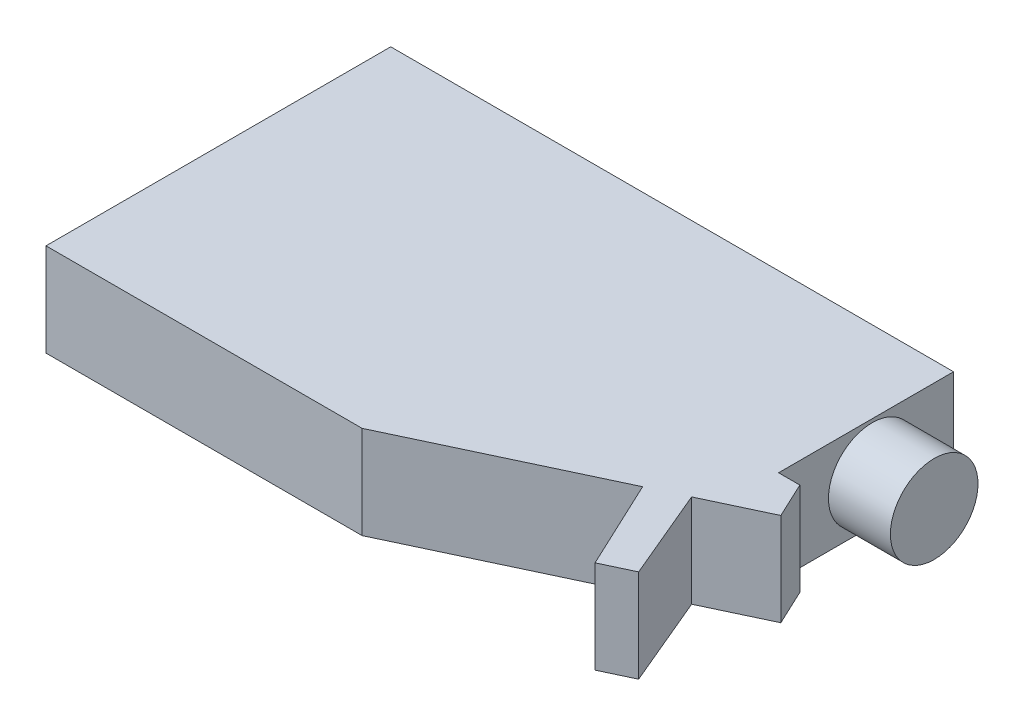
ISO-10303-21;
HEADER;
FILE_DESCRIPTION(('STEP AP214'),'2;1');
FILE_NAME('part.step','',(''),(''),'','','');
FILE_SCHEMA(('AUTOMOTIVE_DESIGN { 1 0 10303 214 1 1 1 1 }'));
ENDSEC;
DATA;
#1=APPLICATION_CONTEXT('core data for automotive mechanical design processes');
#2=APPLICATION_PROTOCOL_DEFINITION('international standard','automotive_design',2000,#1);
#3=PRODUCT_CONTEXT('',#1,'mechanical');
#4=PRODUCT('Part','Part','',(#3));
#5=PRODUCT_RELATED_PRODUCT_CATEGORY('part','',(#4));
#6=PRODUCT_DEFINITION_FORMATION('','',#4);
#7=PRODUCT_DEFINITION_CONTEXT('part definition',#1,'design');
#8=PRODUCT_DEFINITION('design','',#6,#7);
#9=PRODUCT_DEFINITION_SHAPE('','',#8);
#10=(LENGTH_UNIT() NAMED_UNIT(*) SI_UNIT(.MILLI.,.METRE.));
#11=(NAMED_UNIT(*) PLANE_ANGLE_UNIT() SI_UNIT($,.RADIAN.));
#12=(NAMED_UNIT(*) SI_UNIT($,.STERADIAN.) SOLID_ANGLE_UNIT());
#13=UNCERTAINTY_MEASURE_WITH_UNIT(LENGTH_MEASURE(1.E-05),#10,'distance_accuracy_value','');
#14=(GEOMETRIC_REPRESENTATION_CONTEXT(3) GLOBAL_UNCERTAINTY_ASSIGNED_CONTEXT((#13)) GLOBAL_UNIT_ASSIGNED_CONTEXT((#10,
#11,#12)) REPRESENTATION_CONTEXT('',''));
#15=CARTESIAN_POINT('',(0.,0.,0.));
#16=DIRECTION('',(0.,0.,1.));
#17=DIRECTION('',(1.,0.,0.));
#18=AXIS2_PLACEMENT_3D('',#15,#16,#17);
#19=CARTESIAN_POINT('',(55.0748516656309,15.,-19.4495097597613));
#20=DIRECTION('',(-1.,0.,0.));
#21=DIRECTION('',(0.,0.,1.));
#22=AXIS2_PLACEMENT_3D('',#19,#20,#21);
#23=PLANE('',#22);
#24=DIRECTION('',(0.,0.,-1.));
#25=VECTOR('',#24,1.);
#26=CARTESIAN_POINT('',(55.0748516656309,0.,-19.4495097597613));
#27=LINE('',#26,#25);
#28=CARTESIAN_POINT('',(55.0748516656309,0.,-19.4495097597613));
#29=VERTEX_POINT('',#28);
#30=CARTESIAN_POINT('',(55.0748516656309,0.,-47.6936859784845));
#31=VERTEX_POINT('',#30);
#32=EDGE_CURVE('E88',#29,#31,#27,.T.);
#33=ORIENTED_EDGE('',*,*,#32,.T.);
#34=DIRECTION('',(0.,-1.,0.));
#35=VECTOR('',#34,1.);
#36=CARTESIAN_POINT('',(55.0748516656309,15.,-47.6936859784845));
#37=LINE('',#36,#35);
#38=CARTESIAN_POINT('',(55.0748516656309,15.,-47.6936859784845));
#39=VERTEX_POINT('',#38);
#40=EDGE_CURVE('E141',#39,#31,#37,.T.);
#41=ORIENTED_EDGE('',*,*,#40,.F.);
#42=DIRECTION('',(0.,0.,-1.));
#43=VECTOR('',#42,1.);
#44=CARTESIAN_POINT('',(55.0748516656309,15.,-19.4495097597613));
#45=LINE('',#44,#43);
#46=CARTESIAN_POINT('',(55.0748516656309,15.,-19.4495097597613));
#47=VERTEX_POINT('',#46);
#48=EDGE_CURVE('E129',#47,#39,#45,.T.);
#49=ORIENTED_EDGE('',*,*,#48,.F.);
#50=DIRECTION('',(0.,-1.,0.));
#51=VECTOR('',#50,1.);
#52=CARTESIAN_POINT('',(55.0748516656309,15.,-19.4495097597613));
#53=LINE('',#52,#51);
#54=EDGE_CURVE('E136',#47,#29,#53,.T.);
#55=ORIENTED_EDGE('',*,*,#54,.T.);
#56=EDGE_LOOP('',(#33,#41,#49,#55));
#57=FACE_BOUND('',#56,.T.);
#58=CARTESIAN_POINT('',(55.0748516656309,7.37815127772024,-34.5707429763138));
#59=DIRECTION('',(-1.,0.,0.));
#60=DIRECTION('',(0.,0.,1.));
#61=AXIS2_PLACEMENT_3D('',#58,#59,#60);
#62=CIRCLE('',#61,7.06791159610859);
#63=CARTESIAN_POINT('',(55.0748516656309,7.37815127772024,-27.5028313802052));
#64=VERTEX_POINT('',#63);
#65=EDGE_CURVE('E11',#64,#64,#62,.F.);
#66=ORIENTED_EDGE('',*,*,#65,.F.);
#67=EDGE_LOOP('',(#66));
#68=FACE_BOUND('',#67,.T.);
#69=ADVANCED_FACE('F33',(#57,#68),#23,.F.);
#70=CARTESIAN_POINT('',(-35.7702644838633,15.,7.94894766308076));
#71=DIRECTION('',(1.,0.,0.));
#72=DIRECTION('',(0.,0.,-1.));
#73=AXIS2_PLACEMENT_3D('',#70,#71,#72);
#74=PLANE('',#73);
#75=DIRECTION('',(0.,0.,1.));
#76=VECTOR('',#75,1.);
#77=CARTESIAN_POINT('',(-35.7702644838633,0.,7.94894766308076));
#78=LINE('',#77,#76);
#79=CARTESIAN_POINT('',(-35.7702644838633,0.,-47.6936859784845));
#80=VERTEX_POINT('',#79);
#81=CARTESIAN_POINT('',(-35.7702644838633,0.,7.94894766308076));
#82=VERTEX_POINT('',#81);
#83=EDGE_CURVE('E149',#80,#82,#78,.T.);
#84=ORIENTED_EDGE('',*,*,#83,.T.);
#85=DIRECTION('',(0.,-1.,0.));
#86=VECTOR('',#85,1.);
#87=CARTESIAN_POINT('',(-35.7702644838633,15.,7.94894766308076));
#88=LINE('',#87,#86);
#89=CARTESIAN_POINT('',(-35.7702644838633,15.,7.94894766308076));
#90=VERTEX_POINT('',#89);
#91=EDGE_CURVE('E42',#90,#82,#88,.T.);
#92=ORIENTED_EDGE('',*,*,#91,.F.);
#93=DIRECTION('',(0.,0.,1.));
#94=VECTOR('',#93,1.);
#95=CARTESIAN_POINT('',(-35.7702644838633,15.,7.94894766308076));
#96=LINE('',#95,#94);
#97=CARTESIAN_POINT('',(-35.7702644838633,15.,-47.6936859784845));
#98=VERTEX_POINT('',#97);
#99=EDGE_CURVE('E170',#98,#90,#96,.T.);
#100=ORIENTED_EDGE('',*,*,#99,.F.);
#101=DIRECTION('',(0.,-1.,0.));
#102=VECTOR('',#101,1.);
#103=CARTESIAN_POINT('',(-35.7702644838633,15.,-47.6936859784845));
#104=LINE('',#103,#102);
#105=EDGE_CURVE('E145',#98,#80,#104,.T.);
#106=ORIENTED_EDGE('',*,*,#105,.T.);
#107=EDGE_LOOP('',(#84,#92,#100,#106));
#108=FACE_BOUND('',#107,.T.);
#109=ADVANCED_FACE('F35',(#108),#74,.F.);
#110=CARTESIAN_POINT('',(-35.7702644838633,15.,7.94894766308076));
#111=DIRECTION('',(0.,0.,-1.));
#112=DIRECTION('',(-1.,0.,0.));
#113=AXIS2_PLACEMENT_3D('',#110,#111,#112);
#114=PLANE('',#113);
#115=DIRECTION('',(1.,0.,0.));
#116=VECTOR('',#115,1.);
#117=CARTESIAN_POINT('',(-35.7702644838633,0.,7.94894766308076));
#118=LINE('',#117,#116);
#119=CARTESIAN_POINT('',(15.2454545512602,0.,7.94894766308076));
#120=VERTEX_POINT('',#119);
#121=EDGE_CURVE('E152',#82,#120,#118,.T.);
#122=ORIENTED_EDGE('',*,*,#121,.T.);
#123=DIRECTION('',(0.,-1.,0.));
#124=VECTOR('',#123,1.);
#125=CARTESIAN_POINT('',(15.2454545512602,15.,7.94894766308076));
#126=LINE('',#125,#124);
#127=CARTESIAN_POINT('',(15.2454545512602,15.,7.94894766308076));
#128=VERTEX_POINT('',#127);
#129=EDGE_CURVE('E189',#128,#120,#126,.T.);
#130=ORIENTED_EDGE('',*,*,#129,.F.);
#131=DIRECTION('',(1.,0.,0.));
#132=VECTOR('',#131,1.);
#133=CARTESIAN_POINT('',(-35.7702644838633,15.,7.94894766308076));
#134=LINE('',#133,#132);
#135=EDGE_CURVE('E103',#90,#128,#134,.T.);
#136=ORIENTED_EDGE('',*,*,#135,.F.);
#137=ORIENTED_EDGE('',*,*,#91,.T.);
#138=EDGE_LOOP('',(#122,#130,#136,#137));
#139=FACE_BOUND('',#138,.T.);
#140=ADVANCED_FACE('F192',(#139),#114,.F.);
#141=CARTESIAN_POINT('',(15.2454545512602,15.,7.94894766308076));
#142=DIRECTION('',(-0.425361139822422,0.,-0.905023701749833));
#143=DIRECTION('',(-0.905023701749833,0.,0.425361139822422));
#144=AXIS2_PLACEMENT_3D('',#141,#142,#143);
#145=PLANE('',#144);
#146=DIRECTION('',(0.905023701749833,0.,-0.425361139822422));
#147=VECTOR('',#146,1.);
#148=CARTESIAN_POINT('',(15.2454545512602,0.,7.94894766308076));
#149=LINE('',#148,#147);
#150=CARTESIAN_POINT('',(46.0497605499517,0.,-6.52907615630423));
#151=VERTEX_POINT('',#150);
#152=EDGE_CURVE('E155',#120,#151,#149,.T.);
#153=ORIENTED_EDGE('',*,*,#152,.T.);
#154=DIRECTION('',(0.,-1.,0.));
#155=VECTOR('',#154,1.);
#156=CARTESIAN_POINT('',(46.0497605499517,15.,-6.52907615630423));
#157=LINE('',#156,#155);
#158=CARTESIAN_POINT('',(46.0497605499517,15.,-6.52907615630423));
#159=VERTEX_POINT('',#158);
#160=EDGE_CURVE('E186',#159,#151,#157,.T.);
#161=ORIENTED_EDGE('',*,*,#160,.F.);
#162=DIRECTION('',(0.905023701749833,0.,-0.425361139822422));
#163=VECTOR('',#162,1.);
#164=CARTESIAN_POINT('',(15.2454545512602,15.,7.94894766308076));
#165=LINE('',#164,#163);
#166=EDGE_CURVE('E212',#128,#159,#165,.T.);
#167=ORIENTED_EDGE('',*,*,#166,.F.);
#168=ORIENTED_EDGE('',*,*,#129,.T.);
#169=EDGE_LOOP('',(#153,#161,#167,#168));
#170=FACE_BOUND('',#169,.T.);
#171=ADVANCED_FACE('F203',(#170),#145,.F.);
#172=CARTESIAN_POINT('',(46.0497605499517,15.,-6.52907615630423));
#173=DIRECTION('',(0.905023701749833,0.,-0.425361139822422));
#174=DIRECTION('',(-0.425361139822422,0.,-0.905023701749833));
#175=AXIS2_PLACEMENT_3D('',#172,#173,#174);
#176=PLANE('',#175);
#177=DIRECTION('',(0.425361139822422,0.,0.905023701749833));
#178=VECTOR('',#177,1.);
#179=CARTESIAN_POINT('',(46.0497605499517,0.,-6.52907615630423));
#180=LINE('',#179,#178);
#181=CARTESIAN_POINT('',(52.8544317450626,0.,7.94894766308076));
#182=VERTEX_POINT('',#181);
#183=EDGE_CURVE('E157',#151,#182,#180,.T.);
#184=ORIENTED_EDGE('',*,*,#183,.T.);
#185=DIRECTION('',(0.,-1.,0.));
#186=VECTOR('',#185,1.);
#187=CARTESIAN_POINT('',(52.8544317450626,15.,7.94894766308076));
#188=LINE('',#187,#186);
#189=CARTESIAN_POINT('',(52.8544317450626,15.,7.94894766308076));
#190=VERTEX_POINT('',#189);
#191=EDGE_CURVE('E183',#190,#182,#188,.T.);
#192=ORIENTED_EDGE('',*,*,#191,.F.);
#193=DIRECTION('',(0.425361139822422,0.,0.905023701749833));
#194=VECTOR('',#193,1.);
#195=CARTESIAN_POINT('',(46.0497605499517,15.,-6.52907615630423));
#196=LINE('',#195,#194);
#197=EDGE_CURVE('E209',#159,#190,#196,.T.);
#198=ORIENTED_EDGE('',*,*,#197,.F.);
#199=ORIENTED_EDGE('',*,*,#160,.T.);
#200=EDGE_LOOP('',(#184,#192,#198,#199));
#201=FACE_BOUND('',#200,.T.);
#202=ADVANCED_FACE('F207',(#201),#176,.F.);
#203=CARTESIAN_POINT('',(52.8544317450626,15.,7.94894766308076));
#204=DIRECTION('',(-0.425361139822422,0.,-0.905023701749832));
#205=DIRECTION('',(-0.905023701749832,0.,0.425361139822422));
#206=AXIS2_PLACEMENT_3D('',#203,#204,#205);
#207=PLANE('',#206);
#208=DIRECTION('',(0.905023701749832,0.,-0.425361139822422));
#209=VECTOR('',#208,1.);
#210=CARTESIAN_POINT('',(52.8544317450626,0.,7.94894766308076));
#211=LINE('',#210,#209);
#212=CARTESIAN_POINT('',(57.6398517759722,0.,5.69980024855324));
#213=VERTEX_POINT('',#212);
#214=EDGE_CURVE('E159',#182,#213,#211,.T.);
#215=ORIENTED_EDGE('',*,*,#214,.T.);
#216=DIRECTION('',(0.,-1.,0.));
#217=VECTOR('',#216,1.);
#218=CARTESIAN_POINT('',(57.6398517759722,15.,5.69980024855324));
#219=LINE('',#218,#217);
#220=CARTESIAN_POINT('',(57.6398517759722,15.,5.69980024855324));
#221=VERTEX_POINT('',#220);
#222=EDGE_CURVE('E180',#221,#213,#219,.T.);
#223=ORIENTED_EDGE('',*,*,#222,.F.);
#224=DIRECTION('',(0.905023701749832,0.,-0.425361139822422));
#225=VECTOR('',#224,1.);
#226=CARTESIAN_POINT('',(52.8544317450626,15.,7.94894766308076));
#227=LINE('',#226,#225);
#228=EDGE_CURVE('E211',#190,#221,#227,.T.);
#229=ORIENTED_EDGE('',*,*,#228,.F.);
#230=ORIENTED_EDGE('',*,*,#191,.T.);
#231=EDGE_LOOP('',(#215,#223,#229,#230));
#232=FACE_BOUND('',#231,.T.);
#233=ADVANCED_FACE('F236',(#232),#207,.F.);
#234=CARTESIAN_POINT('',(57.6398517759722,15.,5.69980024855324));
#235=DIRECTION('',(-0.921719444816784,0.,0.387857274066943));
#236=DIRECTION('',(0.387857274066943,0.,0.921719444816784));
#237=AXIS2_PLACEMENT_3D('',#234,#235,#236);
#238=PLANE('',#237);
#239=DIRECTION('',(-0.387857274066943,0.,-0.921719444816784));
#240=VECTOR('',#239,1.);
#241=CARTESIAN_POINT('',(57.6398517759722,0.,5.69980024855324));
#242=LINE('',#241,#240);
#243=CARTESIAN_POINT('',(51.4299120578691,0.,-9.05774736502541));
#244=VERTEX_POINT('',#243);
#245=EDGE_CURVE('E161',#213,#244,#242,.T.);
#246=ORIENTED_EDGE('',*,*,#245,.T.);
#247=DIRECTION('',(0.,-1.,0.));
#248=VECTOR('',#247,1.);
#249=CARTESIAN_POINT('',(51.4299120578691,15.,-9.05774736502541));
#250=LINE('',#249,#248);
#251=CARTESIAN_POINT('',(51.4299120578691,15.,-9.05774736502541));
#252=VERTEX_POINT('',#251);
#253=EDGE_CURVE('E177',#252,#244,#250,.T.);
#254=ORIENTED_EDGE('',*,*,#253,.F.);
#255=DIRECTION('',(-0.387857274066943,0.,-0.921719444816784));
#256=VECTOR('',#255,1.);
#257=CARTESIAN_POINT('',(57.6398517759722,15.,5.69980024855324));
#258=LINE('',#257,#256);
#259=EDGE_CURVE('E214',#221,#252,#258,.T.);
#260=ORIENTED_EDGE('',*,*,#259,.F.);
#261=ORIENTED_EDGE('',*,*,#222,.T.);
#262=EDGE_LOOP('',(#246,#254,#260,#261));
#263=FACE_BOUND('',#262,.T.);
#264=ADVANCED_FACE('F233',(#263),#238,.F.);
#265=CARTESIAN_POINT('',(51.4299120578691,15.,-9.05774736502541));
#266=DIRECTION('',(-0.425361139822421,0.,-0.905023701749833));
#267=DIRECTION('',(-0.905023701749833,0.,0.425361139822421));
#268=AXIS2_PLACEMENT_3D('',#265,#266,#267);
#269=PLANE('',#268);
#270=DIRECTION('',(0.905023701749833,0.,-0.425361139822421));
#271=VECTOR('',#270,1.);
#272=CARTESIAN_POINT('',(51.4299120578691,0.,-9.05774736502541));
#273=LINE('',#272,#271);
#274=CARTESIAN_POINT('',(61.2278287640359,0.,-13.6627682169238));
#275=VERTEX_POINT('',#274);
#276=EDGE_CURVE('E163',#244,#275,#273,.T.);
#277=ORIENTED_EDGE('',*,*,#276,.T.);
#278=DIRECTION('',(0.,-1.,0.));
#279=VECTOR('',#278,1.);
#280=CARTESIAN_POINT('',(61.2278287640359,15.,-13.6627682169238));
#281=LINE('',#280,#279);
#282=CARTESIAN_POINT('',(61.2278287640359,15.,-13.6627682169238));
#283=VERTEX_POINT('',#282);
#284=EDGE_CURVE('E174',#283,#275,#281,.T.);
#285=ORIENTED_EDGE('',*,*,#284,.F.);
#286=DIRECTION('',(0.905023701749833,0.,-0.425361139822421));
#287=VECTOR('',#286,1.);
#288=CARTESIAN_POINT('',(51.4299120578691,15.,-9.05774736502541));
#289=LINE('',#288,#287);
#290=EDGE_CURVE('E220',#252,#283,#289,.T.);
#291=ORIENTED_EDGE('',*,*,#290,.F.);
#292=ORIENTED_EDGE('',*,*,#253,.T.);
#293=EDGE_LOOP('',(#277,#285,#291,#292));
#294=FACE_BOUND('',#293,.T.);
#295=ADVANCED_FACE('F226',(#294),#269,.F.);
#296=CARTESIAN_POINT('',(61.2278287640359,15.,-13.6627682169238));
#297=DIRECTION('',(-0.905023701749833,0.,0.425361139822422));
#298=DIRECTION('',(0.425361139822422,0.,0.905023701749833));
#299=AXIS2_PLACEMENT_3D('',#296,#297,#298);
#300=PLANE('',#299);
#301=DIRECTION('',(-0.425361139822422,0.,-0.905023701749833));
#302=VECTOR('',#301,1.);
#303=CARTESIAN_POINT('',(61.2278287640359,0.,-13.6627682169238));
#304=LINE('',#303,#302);
#305=CARTESIAN_POINT('',(58.5080602389022,0.,-19.4495097597613));
#306=VERTEX_POINT('',#305);
#307=EDGE_CURVE('E165',#275,#306,#304,.T.);
#308=ORIENTED_EDGE('',*,*,#307,.T.);
#309=DIRECTION('',(0.,-1.,0.));
#310=VECTOR('',#309,1.);
#311=CARTESIAN_POINT('',(58.5080602389022,15.,-19.4495097597613));
#312=LINE('',#311,#310);
#313=CARTESIAN_POINT('',(58.5080602389022,15.,-19.4495097597613));
#314=VERTEX_POINT('',#313);
#315=EDGE_CURVE('E140',#314,#306,#312,.T.);
#316=ORIENTED_EDGE('',*,*,#315,.F.);
#317=DIRECTION('',(-0.425361139822422,0.,-0.905023701749833));
#318=VECTOR('',#317,1.);
#319=CARTESIAN_POINT('',(61.2278287640359,15.,-13.6627682169238));
#320=LINE('',#319,#318);
#321=EDGE_CURVE('E131',#283,#314,#320,.T.);
#322=ORIENTED_EDGE('',*,*,#321,.F.);
#323=ORIENTED_EDGE('',*,*,#284,.T.);
#324=EDGE_LOOP('',(#308,#316,#322,#323));
#325=FACE_BOUND('',#324,.T.);
#326=ADVANCED_FACE('F230',(#325),#300,.F.);
#327=CARTESIAN_POINT('',(58.5080602389022,15.,-19.4495097597613));
#328=DIRECTION('',(0.,0.,1.));
#329=DIRECTION('',(1.,0.,0.));
#330=AXIS2_PLACEMENT_3D('',#327,#328,#329);
#331=PLANE('',#330);
#332=DIRECTION('',(-1.,0.,0.));
#333=VECTOR('',#332,1.);
#334=CARTESIAN_POINT('',(58.5080602389022,0.,-19.4495097597613));
#335=LINE('',#334,#333);
#336=EDGE_CURVE('E139',#306,#29,#335,.T.);
#337=ORIENTED_EDGE('',*,*,#336,.T.);
#338=ORIENTED_EDGE('',*,*,#54,.F.);
#339=DIRECTION('',(-1.,0.,0.));
#340=VECTOR('',#339,1.);
#341=CARTESIAN_POINT('',(58.5080602389022,15.,-19.4495097597613));
#342=LINE('',#341,#340);
#343=EDGE_CURVE('E125',#314,#47,#342,.T.);
#344=ORIENTED_EDGE('',*,*,#343,.F.);
#345=ORIENTED_EDGE('',*,*,#315,.T.);
#346=EDGE_LOOP('',(#337,#338,#344,#345));
#347=FACE_BOUND('',#346,.T.);
#348=ADVANCED_FACE('F137',(#347),#331,.F.);
#349=CARTESIAN_POINT('',(-35.7702644838633,15.,-47.6936859784845));
#350=DIRECTION('',(0.,0.,1.));
#351=DIRECTION('',(1.,0.,0.));
#352=AXIS2_PLACEMENT_3D('',#349,#350,#351);
#353=PLANE('',#352);
#354=DIRECTION('',(-1.,0.,0.));
#355=VECTOR('',#354,1.);
#356=CARTESIAN_POINT('',(-35.7702644838633,0.,-47.6936859784845));
#357=LINE('',#356,#355);
#358=EDGE_CURVE('E94',#31,#80,#357,.T.);
#359=ORIENTED_EDGE('',*,*,#358,.T.);
#360=ORIENTED_EDGE('',*,*,#105,.F.);
#361=DIRECTION('',(-1.,0.,0.));
#362=VECTOR('',#361,1.);
#363=CARTESIAN_POINT('',(-35.7702644838633,15.,-47.6936859784845));
#364=LINE('',#363,#362);
#365=EDGE_CURVE('E50',#39,#98,#364,.T.);
#366=ORIENTED_EDGE('',*,*,#365,.F.);
#367=ORIENTED_EDGE('',*,*,#40,.T.);
#368=EDGE_LOOP('',(#359,#360,#366,#367));
#369=FACE_BOUND('',#368,.T.);
#370=ADVANCED_FACE('F252',(#369),#353,.F.);
#371=CARTESIAN_POINT('',(0.,15.,0.));
#372=DIRECTION('',(0.,-1.,0.));
#373=DIRECTION('',(0.,0.,-1.));
#374=AXIS2_PLACEMENT_3D('',#371,#372,#373);
#375=PLANE('',#374);
#376=ORIENTED_EDGE('',*,*,#99,.T.);
#377=ORIENTED_EDGE('',*,*,#135,.T.);
#378=ORIENTED_EDGE('',*,*,#166,.T.);
#379=ORIENTED_EDGE('',*,*,#197,.T.);
#380=ORIENTED_EDGE('',*,*,#228,.T.);
#381=ORIENTED_EDGE('',*,*,#259,.T.);
#382=ORIENTED_EDGE('',*,*,#290,.T.);
#383=ORIENTED_EDGE('',*,*,#321,.T.);
#384=ORIENTED_EDGE('',*,*,#343,.T.);
#385=ORIENTED_EDGE('',*,*,#48,.T.);
#386=ORIENTED_EDGE('',*,*,#365,.T.);
#387=EDGE_LOOP('',(#376,#377,#378,#379,#380,#381,#382,#383,#384,#385,#386));
#388=FACE_BOUND('',#387,.T.);
#389=ADVANCED_FACE('F127',(#388),#375,.F.);
#390=CARTESIAN_POINT('',(0.,0.,0.));
#391=DIRECTION('',(0.,-1.,0.));
#392=DIRECTION('',(0.,0.,-1.));
#393=AXIS2_PLACEMENT_3D('',#390,#391,#392);
#394=PLANE('',#393);
#395=ORIENTED_EDGE('',*,*,#83,.F.);
#396=ORIENTED_EDGE('',*,*,#358,.F.);
#397=ORIENTED_EDGE('',*,*,#32,.F.);
#398=ORIENTED_EDGE('',*,*,#336,.F.);
#399=ORIENTED_EDGE('',*,*,#307,.F.);
#400=ORIENTED_EDGE('',*,*,#276,.F.);
#401=ORIENTED_EDGE('',*,*,#245,.F.);
#402=ORIENTED_EDGE('',*,*,#214,.F.);
#403=ORIENTED_EDGE('',*,*,#183,.F.);
#404=ORIENTED_EDGE('',*,*,#152,.F.);
#405=ORIENTED_EDGE('',*,*,#121,.F.);
#406=EDGE_LOOP('',(#395,#396,#397,#398,#399,#400,#401,#402,#403,#404,#405));
#407=FACE_BOUND('',#406,.T.);
#408=ADVANCED_FACE('F197',(#407),#394,.T.);
#409=CARTESIAN_POINT('',(65.0748516656309,7.37815127772024,-34.5707429763138));
#410=DIRECTION('',(-1.,0.,0.));
#411=DIRECTION('',(0.,0.,1.));
#412=AXIS2_PLACEMENT_3D('',#409,#410,#411);
#413=CYLINDRICAL_SURFACE('',#412,7.06791159610859);
#414=CARTESIAN_POINT('',(65.0748516656309,7.37815127772024,-34.5707429763138));
#415=DIRECTION('',(1.,0.,0.));
#416=DIRECTION('',(0.,0.,-1.));
#417=AXIS2_PLACEMENT_3D('',#414,#415,#416);
#418=CIRCLE('',#417,7.06791159610859);
#419=CARTESIAN_POINT('',(65.0748516656309,7.37815127772024,-41.6386545724224));
#420=VERTEX_POINT('',#419);
#421=EDGE_CURVE('E153',#420,#420,#418,.T.);
#422=ORIENTED_EDGE('',*,*,#421,.F.);
#423=EDGE_LOOP('',(#422));
#424=FACE_BOUND('',#423,.T.);
#425=ORIENTED_EDGE('',*,*,#65,.T.);
#426=EDGE_LOOP('',(#425));
#427=FACE_BOUND('',#426,.T.);
#428=ADVANCED_FACE('F288',(#424,#427),#413,.T.);
#429=CARTESIAN_POINT('',(65.0748516656309,7.37815127772024,-34.5707429763138));
#430=DIRECTION('',(1.,0.,0.));
#431=DIRECTION('',(0.,0.,-1.));
#432=AXIS2_PLACEMENT_3D('',#429,#430,#431);
#433=PLANE('',#432);
#434=ORIENTED_EDGE('',*,*,#421,.T.);
#435=EDGE_LOOP('',(#434));
#436=FACE_BOUND('',#435,.T.);
#437=ADVANCED_FACE('F294',(#436),#433,.T.);
#438=CLOSED_SHELL('',(#69,#109,#140,#171,#202,#233,#264,#295,#326,#348,#370,#389,#408,#428,#437));
#439=MANIFOLD_SOLID_BREP('B2',#438);
#440=ADVANCED_BREP_SHAPE_REPRESENTATION('',(#18,#439),#14);
#441=SHAPE_DEFINITION_REPRESENTATION(#9,#440);
ENDSEC;
END-ISO-10303-21;
